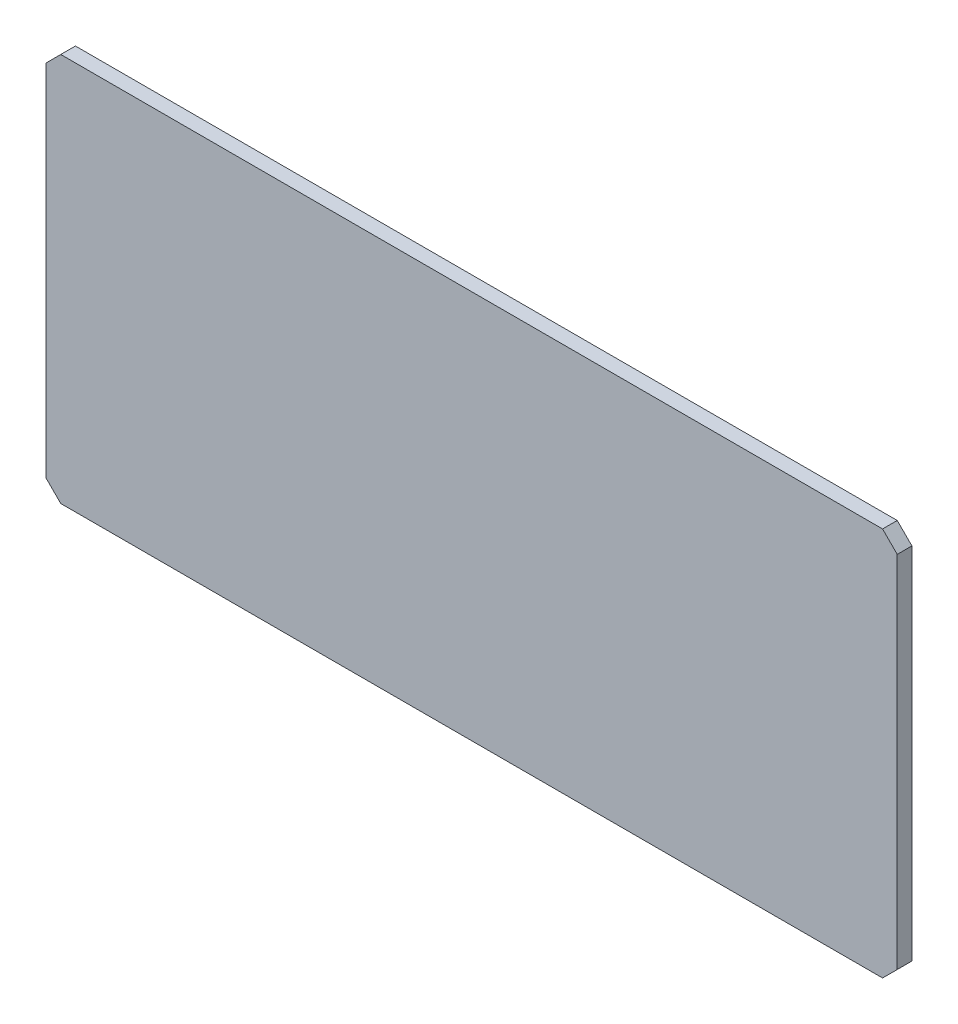
ISO-10303-21;
HEADER;
FILE_DESCRIPTION(('STEP AP214'),'2;1');
FILE_NAME('part.step','',(''),(''),'','','');
FILE_SCHEMA(('AUTOMOTIVE_DESIGN { 1 0 10303 214 1 1 1 1 }'));
ENDSEC;
DATA;
#1=APPLICATION_CONTEXT('core data for automotive mechanical design processes');
#2=APPLICATION_PROTOCOL_DEFINITION('international standard','automotive_design',2000,#1);
#3=PRODUCT_CONTEXT('',#1,'mechanical');
#4=PRODUCT('Part','Part','',(#3));
#5=PRODUCT_RELATED_PRODUCT_CATEGORY('part','',(#4));
#6=PRODUCT_DEFINITION_FORMATION('','',#4);
#7=PRODUCT_DEFINITION_CONTEXT('part definition',#1,'design');
#8=PRODUCT_DEFINITION('design','',#6,#7);
#9=PRODUCT_DEFINITION_SHAPE('','',#8);
#10=(LENGTH_UNIT() NAMED_UNIT(*) SI_UNIT(.MILLI.,.METRE.));
#11=(NAMED_UNIT(*) PLANE_ANGLE_UNIT() SI_UNIT($,.RADIAN.));
#12=(NAMED_UNIT(*) SI_UNIT($,.STERADIAN.) SOLID_ANGLE_UNIT());
#13=UNCERTAINTY_MEASURE_WITH_UNIT(LENGTH_MEASURE(1.E-05),#10,'distance_accuracy_value','');
#14=(GEOMETRIC_REPRESENTATION_CONTEXT(3) GLOBAL_UNCERTAINTY_ASSIGNED_CONTEXT((#13)) GLOBAL_UNIT_ASSIGNED_CONTEXT((#10,
#11,#12)) REPRESENTATION_CONTEXT('',''));
#15=CARTESIAN_POINT('',(0.,0.,0.));
#16=DIRECTION('',(0.,0.,1.));
#17=DIRECTION('',(1.,0.,0.));
#18=AXIS2_PLACEMENT_3D('',#15,#16,#17);
#19=CARTESIAN_POINT('',(0.,0.,2.));
#20=DIRECTION('',(-1.,0.,0.));
#21=DIRECTION('',(0.,0.,1.));
#22=AXIS2_PLACEMENT_3D('',#19,#20,#21);
#23=PLANE('',#22);
#24=DIRECTION('',(0.,1.,0.));
#25=VECTOR('',#24,1.);
#26=CARTESIAN_POINT('',(0.,0.,2.));
#27=LINE('',#26,#25);
#28=CARTESIAN_POINT('',(0.,2.,2.));
#29=VERTEX_POINT('',#28);
#30=CARTESIAN_POINT('',(0.,51.,2.));
#31=VERTEX_POINT('',#30);
#32=EDGE_CURVE('E110',#29,#31,#27,.T.);
#33=ORIENTED_EDGE('',*,*,#32,.F.);
#34=DIRECTION('',(0.,0.,-1.));
#35=VECTOR('',#34,1.);
#36=CARTESIAN_POINT('',(0.,2.,2.));
#37=LINE('',#36,#35);
#38=CARTESIAN_POINT('',(0.,2.,0.));
#39=VERTEX_POINT('',#38);
#40=EDGE_CURVE('E95',#29,#39,#37,.T.);
#41=ORIENTED_EDGE('',*,*,#40,.T.);
#42=DIRECTION('',(0.,1.,0.));
#43=VECTOR('',#42,1.);
#44=CARTESIAN_POINT('',(0.,0.,0.));
#45=LINE('',#44,#43);
#46=CARTESIAN_POINT('',(0.,51.,0.));
#47=VERTEX_POINT('',#46);
#48=EDGE_CURVE('E107',#39,#47,#45,.T.);
#49=ORIENTED_EDGE('',*,*,#48,.T.);
#50=DIRECTION('',(0.,0.,1.));
#51=VECTOR('',#50,1.);
#52=CARTESIAN_POINT('',(0.,51.,2.));
#53=LINE('',#52,#51);
#54=EDGE_CURVE('E112',#47,#31,#53,.T.);
#55=ORIENTED_EDGE('',*,*,#54,.T.);
#56=EDGE_LOOP('',(#33,#41,#49,#55));
#57=FACE_BOUND('',#56,.T.);
#58=ADVANCED_FACE('F27',(#57),#23,.F.);
#59=CARTESIAN_POINT('',(0.,53.,2.));
#60=DIRECTION('',(0.,-1.,0.));
#61=DIRECTION('',(1.,0.,0.));
#62=AXIS2_PLACEMENT_3D('',#59,#60,#61);
#63=PLANE('',#62);
#64=DIRECTION('',(-1.,0.,0.));
#65=VECTOR('',#64,1.);
#66=CARTESIAN_POINT('',(0.,53.,2.));
#67=LINE('',#66,#65);
#68=CARTESIAN_POINT('',(-2.00000000000002,53.,2.));
#69=VERTEX_POINT('',#68);
#70=CARTESIAN_POINT('',(-114.,53.,2.));
#71=VERTEX_POINT('',#70);
#72=EDGE_CURVE('E126',#69,#71,#67,.T.);
#73=ORIENTED_EDGE('',*,*,#72,.F.);
#74=DIRECTION('',(0.,0.,-1.));
#75=VECTOR('',#74,1.);
#76=CARTESIAN_POINT('',(-2.00000000000002,53.,2.));
#77=LINE('',#76,#75);
#78=CARTESIAN_POINT('',(-2.00000000000001,53.,0.));
#79=VERTEX_POINT('',#78);
#80=EDGE_CURVE('E150',#69,#79,#77,.T.);
#81=ORIENTED_EDGE('',*,*,#80,.T.);
#82=DIRECTION('',(-1.,0.,0.));
#83=VECTOR('',#82,1.);
#84=CARTESIAN_POINT('',(0.,53.,0.));
#85=LINE('',#84,#83);
#86=CARTESIAN_POINT('',(-114.,53.,0.));
#87=VERTEX_POINT('',#86);
#88=EDGE_CURVE('E116',#79,#87,#85,.T.);
#89=ORIENTED_EDGE('',*,*,#88,.T.);
#90=DIRECTION('',(0.,0.,1.));
#91=VECTOR('',#90,1.);
#92=CARTESIAN_POINT('',(-114.,53.,2.));
#93=LINE('',#92,#91);
#94=EDGE_CURVE('E148',#87,#71,#93,.T.);
#95=ORIENTED_EDGE('',*,*,#94,.T.);
#96=EDGE_LOOP('',(#73,#81,#89,#95));
#97=FACE_BOUND('',#96,.T.);
#98=ADVANCED_FACE('F171',(#97),#63,.F.);
#99=CARTESIAN_POINT('',(-116.,0.,2.));
#100=DIRECTION('',(1.,0.,0.));
#101=DIRECTION('',(0.,0.,-1.));
#102=AXIS2_PLACEMENT_3D('',#99,#100,#101);
#103=PLANE('',#102);
#104=DIRECTION('',(0.,-1.,0.));
#105=VECTOR('',#104,1.);
#106=CARTESIAN_POINT('',(-116.,0.,0.));
#107=LINE('',#106,#105);
#108=CARTESIAN_POINT('',(-116.,51.,0.));
#109=VERTEX_POINT('',#108);
#110=CARTESIAN_POINT('',(-116.,2.,0.));
#111=VERTEX_POINT('',#110);
#112=EDGE_CURVE('E119',#109,#111,#107,.T.);
#113=ORIENTED_EDGE('',*,*,#112,.T.);
#114=DIRECTION('',(0.,0.,1.));
#115=VECTOR('',#114,1.);
#116=CARTESIAN_POINT('',(-116.,2.,2.));
#117=LINE('',#116,#115);
#118=CARTESIAN_POINT('',(-116.,2.00000000000003,2.));
#119=VERTEX_POINT('',#118);
#120=EDGE_CURVE('E11',#111,#119,#117,.T.);
#121=ORIENTED_EDGE('',*,*,#120,.T.);
#122=DIRECTION('',(0.,-1.,0.));
#123=VECTOR('',#122,1.);
#124=CARTESIAN_POINT('',(-116.,0.,2.));
#125=LINE('',#124,#123);
#126=CARTESIAN_POINT('',(-116.,50.9999999999999,2.));
#127=VERTEX_POINT('',#126);
#128=EDGE_CURVE('E128',#127,#119,#125,.T.);
#129=ORIENTED_EDGE('',*,*,#128,.F.);
#130=DIRECTION('',(0.,0.,-1.));
#131=VECTOR('',#130,1.);
#132=CARTESIAN_POINT('',(-116.,51.,2.));
#133=LINE('',#132,#131);
#134=EDGE_CURVE('E34',#127,#109,#133,.T.);
#135=ORIENTED_EDGE('',*,*,#134,.T.);
#136=EDGE_LOOP('',(#113,#121,#129,#135));
#137=FACE_BOUND('',#136,.T.);
#138=ADVANCED_FACE('F155',(#137),#103,.F.);
#139=CARTESIAN_POINT('',(0.,0.,2.));
#140=DIRECTION('',(0.,1.,0.));
#141=DIRECTION('',(-1.,0.,0.));
#142=AXIS2_PLACEMENT_3D('',#139,#140,#141);
#143=PLANE('',#142);
#144=DIRECTION('',(1.,0.,0.));
#145=VECTOR('',#144,1.);
#146=CARTESIAN_POINT('',(0.,0.,0.));
#147=LINE('',#146,#145);
#148=CARTESIAN_POINT('',(-114.,0.,0.));
#149=VERTEX_POINT('',#148);
#150=CARTESIAN_POINT('',(-1.99999999999999,0.,0.));
#151=VERTEX_POINT('',#150);
#152=EDGE_CURVE('E123',#149,#151,#147,.T.);
#153=ORIENTED_EDGE('',*,*,#152,.T.);
#154=DIRECTION('',(0.,0.,1.));
#155=VECTOR('',#154,1.);
#156=CARTESIAN_POINT('',(-1.99999999999999,0.,2.));
#157=LINE('',#156,#155);
#158=CARTESIAN_POINT('',(-2.,0.,2.));
#159=VERTEX_POINT('',#158);
#160=EDGE_CURVE('E96',#151,#159,#157,.T.);
#161=ORIENTED_EDGE('',*,*,#160,.T.);
#162=DIRECTION('',(1.,0.,0.));
#163=VECTOR('',#162,1.);
#164=CARTESIAN_POINT('',(0.,0.,2.));
#165=LINE('',#164,#163);
#166=CARTESIAN_POINT('',(-114.,0.,2.));
#167=VERTEX_POINT('',#166);
#168=EDGE_CURVE('E130',#167,#159,#165,.T.);
#169=ORIENTED_EDGE('',*,*,#168,.F.);
#170=DIRECTION('',(0.,0.,-1.));
#171=VECTOR('',#170,1.);
#172=CARTESIAN_POINT('',(-114.,0.,2.));
#173=LINE('',#172,#171);
#174=EDGE_CURVE('E101',#167,#149,#173,.T.);
#175=ORIENTED_EDGE('',*,*,#174,.T.);
#176=EDGE_LOOP('',(#153,#161,#169,#175));
#177=FACE_BOUND('',#176,.T.);
#178=ADVANCED_FACE('F163',(#177),#143,.F.);
#179=CARTESIAN_POINT('',(0.,53.,2.));
#180=DIRECTION('',(0.,0.,1.));
#181=DIRECTION('',(1.,0.,0.));
#182=AXIS2_PLACEMENT_3D('',#179,#180,#181);
#183=PLANE('',#182);
#184=ORIENTED_EDGE('',*,*,#168,.T.);
#185=DIRECTION('',(-0.707106781186545,-0.70710678118655,0.));
#186=VECTOR('',#185,1.);
#187=CARTESIAN_POINT('',(25.5,27.5000000000002,2.));
#188=LINE('',#187,#186);
#189=EDGE_CURVE('E146',#159,#29,#188,.F.);
#190=ORIENTED_EDGE('',*,*,#189,.T.);
#191=ORIENTED_EDGE('',*,*,#32,.T.);
#192=DIRECTION('',(0.707106781186548,-0.707106781186548,0.));
#193=VECTOR('',#192,1.);
#194=CARTESIAN_POINT('',(-1.00000000000001,52.,2.));
#195=LINE('',#194,#193);
#196=EDGE_CURVE('E144',#31,#69,#195,.F.);
#197=ORIENTED_EDGE('',*,*,#196,.T.);
#198=ORIENTED_EDGE('',*,*,#72,.T.);
#199=DIRECTION('',(0.707106781186548,0.707106781186548,0.));
#200=VECTOR('',#199,1.);
#201=CARTESIAN_POINT('',(-57.,110.,2.));
#202=LINE('',#201,#200);
#203=EDGE_CURVE('E46',#71,#127,#202,.F.);
#204=ORIENTED_EDGE('',*,*,#203,.T.);
#205=ORIENTED_EDGE('',*,*,#128,.T.);
#206=DIRECTION('',(-0.707106781186545,0.70710678118655,0.));
#207=VECTOR('',#206,1.);
#208=CARTESIAN_POINT('',(-83.5000000000004,-30.4999999999998,2.));
#209=LINE('',#208,#207);
#210=EDGE_CURVE('E142',#119,#167,#209,.F.);
#211=ORIENTED_EDGE('',*,*,#210,.T.);
#212=EDGE_LOOP('',(#184,#190,#191,#197,#198,#204,#205,#211));
#213=FACE_BOUND('',#212,.T.);
#214=ADVANCED_FACE('F164',(#213),#183,.T.);
#215=CARTESIAN_POINT('',(0.,53.,0.));
#216=DIRECTION('',(0.,0.,1.));
#217=DIRECTION('',(1.,0.,0.));
#218=AXIS2_PLACEMENT_3D('',#215,#216,#217);
#219=PLANE('',#218);
#220=ORIENTED_EDGE('',*,*,#48,.F.);
#221=DIRECTION('',(0.707106781186545,0.70710678118655,0.));
#222=VECTOR('',#221,1.);
#223=CARTESIAN_POINT('',(0.,2.,0.));
#224=LINE('',#223,#222);
#225=EDGE_CURVE('E91',#39,#151,#224,.F.);
#226=ORIENTED_EDGE('',*,*,#225,.T.);
#227=ORIENTED_EDGE('',*,*,#152,.F.);
#228=DIRECTION('',(0.707106781186545,-0.70710678118655,0.));
#229=VECTOR('',#228,1.);
#230=CARTESIAN_POINT('',(-114.,0.,0.));
#231=LINE('',#230,#229);
#232=EDGE_CURVE('E135',#149,#111,#231,.F.);
#233=ORIENTED_EDGE('',*,*,#232,.T.);
#234=ORIENTED_EDGE('',*,*,#112,.F.);
#235=DIRECTION('',(-0.707106781186548,-0.707106781186548,0.));
#236=VECTOR('',#235,1.);
#237=CARTESIAN_POINT('',(-116.,51.,0.));
#238=LINE('',#237,#236);
#239=EDGE_CURVE('E111',#109,#87,#238,.F.);
#240=ORIENTED_EDGE('',*,*,#239,.T.);
#241=ORIENTED_EDGE('',*,*,#88,.F.);
#242=DIRECTION('',(-0.707106781186548,0.707106781186548,0.));
#243=VECTOR('',#242,1.);
#244=CARTESIAN_POINT('',(-2.00000000000002,53.,0.));
#245=LINE('',#244,#243);
#246=EDGE_CURVE('E102',#79,#47,#245,.F.);
#247=ORIENTED_EDGE('',*,*,#246,.T.);
#248=EDGE_LOOP('',(#220,#226,#227,#233,#234,#240,#241,#247));
#249=FACE_BOUND('',#248,.T.);
#250=ADVANCED_FACE('F114',(#249),#219,.F.);
#251=CARTESIAN_POINT('',(0.,2.,2.));
#252=DIRECTION('',(-0.70710678118655,0.707106781186545,0.));
#253=DIRECTION('',(-0.707106781186545,-0.70710678118655,0.));
#254=AXIS2_PLACEMENT_3D('',#251,#252,#253);
#255=PLANE('',#254);
#256=ORIENTED_EDGE('',*,*,#189,.F.);
#257=ORIENTED_EDGE('',*,*,#160,.F.);
#258=ORIENTED_EDGE('',*,*,#225,.F.);
#259=ORIENTED_EDGE('',*,*,#40,.F.);
#260=EDGE_LOOP('',(#256,#257,#258,#259));
#261=FACE_BOUND('',#260,.T.);
#262=ADVANCED_FACE('F94',(#261),#255,.F.);
#263=CARTESIAN_POINT('',(-2.00000000000002,53.,2.));
#264=DIRECTION('',(-0.707106781186547,-0.707106781186547,0.));
#265=DIRECTION('',(0.707106781186548,-0.707106781186548,0.));
#266=AXIS2_PLACEMENT_3D('',#263,#264,#265);
#267=PLANE('',#266);
#268=ORIENTED_EDGE('',*,*,#196,.F.);
#269=ORIENTED_EDGE('',*,*,#54,.F.);
#270=ORIENTED_EDGE('',*,*,#246,.F.);
#271=ORIENTED_EDGE('',*,*,#80,.F.);
#272=EDGE_LOOP('',(#268,#269,#270,#271));
#273=FACE_BOUND('',#272,.T.);
#274=ADVANCED_FACE('F169',(#273),#267,.F.);
#275=CARTESIAN_POINT('',(-114.,0.,2.));
#276=DIRECTION('',(0.70710678118655,0.707106781186545,0.));
#277=DIRECTION('',(-0.707106781186545,0.70710678118655,0.));
#278=AXIS2_PLACEMENT_3D('',#275,#276,#277);
#279=PLANE('',#278);
#280=ORIENTED_EDGE('',*,*,#210,.F.);
#281=ORIENTED_EDGE('',*,*,#120,.F.);
#282=ORIENTED_EDGE('',*,*,#232,.F.);
#283=ORIENTED_EDGE('',*,*,#174,.F.);
#284=EDGE_LOOP('',(#280,#281,#282,#283));
#285=FACE_BOUND('',#284,.T.);
#286=ADVANCED_FACE('F160',(#285),#279,.F.);
#287=CARTESIAN_POINT('',(-116.,51.,2.));
#288=DIRECTION('',(0.707106781186547,-0.707106781186547,0.));
#289=DIRECTION('',(0.707106781186548,0.707106781186548,0.));
#290=AXIS2_PLACEMENT_3D('',#287,#288,#289);
#291=PLANE('',#290);
#292=ORIENTED_EDGE('',*,*,#203,.F.);
#293=ORIENTED_EDGE('',*,*,#94,.F.);
#294=ORIENTED_EDGE('',*,*,#239,.F.);
#295=ORIENTED_EDGE('',*,*,#134,.F.);
#296=EDGE_LOOP('',(#292,#293,#294,#295));
#297=FACE_BOUND('',#296,.T.);
#298=ADVANCED_FACE('F173',(#297),#291,.F.);
#299=CLOSED_SHELL('',(#58,#98,#138,#178,#214,#250,#262,#274,#286,#298));
#300=MANIFOLD_SOLID_BREP('B2',#299);
#301=ADVANCED_BREP_SHAPE_REPRESENTATION('',(#18,#300),#14);
#302=SHAPE_DEFINITION_REPRESENTATION(#9,#301);
ENDSEC;
END-ISO-10303-21;
